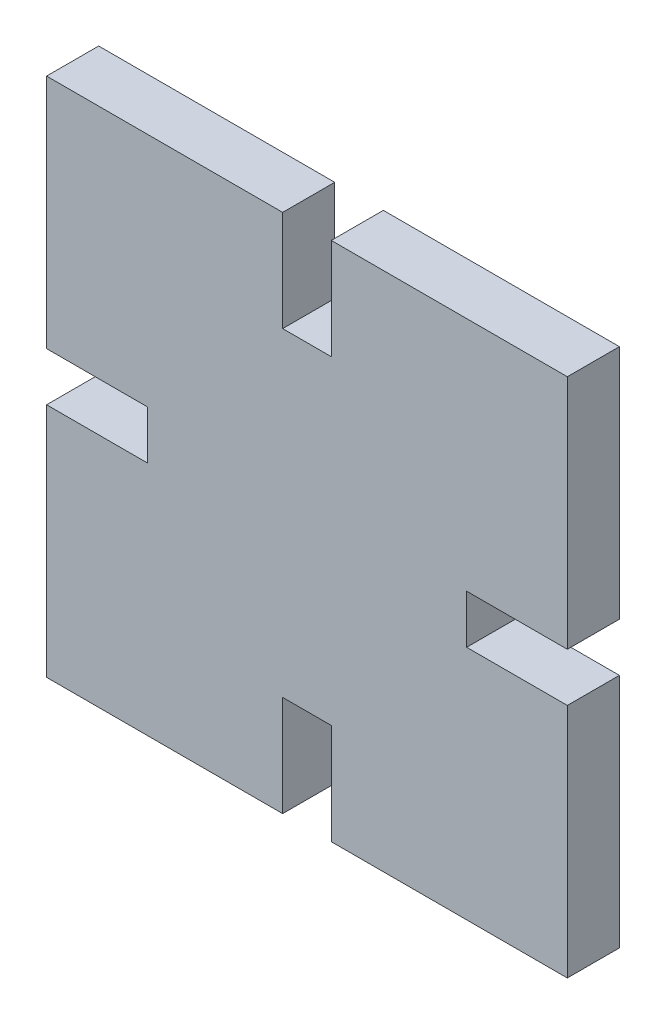
ISO-10303-21;
HEADER;
FILE_DESCRIPTION(('STEP AP214'),'2;1');
FILE_NAME('part.step','',(''),(''),'','','');
FILE_SCHEMA(('AUTOMOTIVE_DESIGN { 1 0 10303 214 1 1 1 1 }'));
ENDSEC;
DATA;
#1=APPLICATION_CONTEXT('core data for automotive mechanical design processes');
#2=APPLICATION_PROTOCOL_DEFINITION('international standard','automotive_design',2000,#1);
#3=PRODUCT_CONTEXT('',#1,'mechanical');
#4=PRODUCT('Part','Part','',(#3));
#5=PRODUCT_RELATED_PRODUCT_CATEGORY('part','',(#4));
#6=PRODUCT_DEFINITION_FORMATION('','',#4);
#7=PRODUCT_DEFINITION_CONTEXT('part definition',#1,'design');
#8=PRODUCT_DEFINITION('design','',#6,#7);
#9=PRODUCT_DEFINITION_SHAPE('','',#8);
#10=(LENGTH_UNIT() NAMED_UNIT(*) SI_UNIT(.MILLI.,.METRE.));
#11=(NAMED_UNIT(*) PLANE_ANGLE_UNIT() SI_UNIT($,.RADIAN.));
#12=(NAMED_UNIT(*) SI_UNIT($,.STERADIAN.) SOLID_ANGLE_UNIT());
#13=UNCERTAINTY_MEASURE_WITH_UNIT(LENGTH_MEASURE(1.E-05),#10,'distance_accuracy_value','');
#14=(GEOMETRIC_REPRESENTATION_CONTEXT(3) GLOBAL_UNCERTAINTY_ASSIGNED_CONTEXT((#13)) GLOBAL_UNIT_ASSIGNED_CONTEXT((#10,
#11,#12)) REPRESENTATION_CONTEXT('',''));
#15=CARTESIAN_POINT('',(0.,0.,0.));
#16=DIRECTION('',(0.,0.,1.));
#17=DIRECTION('',(1.,0.,0.));
#18=AXIS2_PLACEMENT_3D('',#15,#16,#17);
#19=CARTESIAN_POINT('',(15.,-15.,3.));
#20=DIRECTION('',(-1.,0.,0.));
#21=DIRECTION('',(0.,0.,1.));
#22=AXIS2_PLACEMENT_3D('',#19,#20,#21);
#23=PLANE('',#22);
#24=DIRECTION('',(0.,1.,0.));
#25=VECTOR('',#24,1.);
#26=CARTESIAN_POINT('',(15.,-15.,0.));
#27=LINE('',#26,#25);
#28=CARTESIAN_POINT('',(15.,-15.,0.));
#29=VERTEX_POINT('',#28);
#30=CARTESIAN_POINT('',(15.,-1.4,0.));
#31=VERTEX_POINT('',#30);
#32=EDGE_CURVE('E309',#29,#31,#27,.T.);
#33=ORIENTED_EDGE('',*,*,#32,.T.);
#34=DIRECTION('',(0.,0.,1.));
#35=VECTOR('',#34,1.);
#36=CARTESIAN_POINT('',(15.,-1.4,0.));
#37=LINE('',#36,#35);
#38=CARTESIAN_POINT('',(15.,-1.4,3.));
#39=VERTEX_POINT('',#38);
#40=EDGE_CURVE('E216',#31,#39,#37,.T.);
#41=ORIENTED_EDGE('',*,*,#40,.T.);
#42=DIRECTION('',(0.,1.,0.));
#43=VECTOR('',#42,1.);
#44=CARTESIAN_POINT('',(15.,-15.,3.));
#45=LINE('',#44,#43);
#46=CARTESIAN_POINT('',(15.,-15.,3.));
#47=VERTEX_POINT('',#46);
#48=EDGE_CURVE('E292',#47,#39,#45,.T.);
#49=ORIENTED_EDGE('',*,*,#48,.F.);
#50=DIRECTION('',(0.,0.,-1.));
#51=VECTOR('',#50,1.);
#52=CARTESIAN_POINT('',(15.,-15.,3.));
#53=LINE('',#52,#51);
#54=EDGE_CURVE('E308',#47,#29,#53,.T.);
#55=ORIENTED_EDGE('',*,*,#54,.T.);
#56=EDGE_LOOP('',(#33,#41,#49,#55));
#57=FACE_BOUND('',#56,.T.);
#58=ADVANCED_FACE('F33',(#57),#23,.F.);
#59=CARTESIAN_POINT('',(-15.,15.,3.));
#60=DIRECTION('',(0.,-1.,0.));
#61=DIRECTION('',(0.,0.,-1.));
#62=AXIS2_PLACEMENT_3D('',#59,#60,#61);
#63=PLANE('',#62);
#64=DIRECTION('',(-1.,0.,0.));
#65=VECTOR('',#64,1.);
#66=CARTESIAN_POINT('',(-15.,15.,3.));
#67=LINE('',#66,#65);
#68=CARTESIAN_POINT('',(-1.4,15.,3.));
#69=VERTEX_POINT('',#68);
#70=CARTESIAN_POINT('',(-15.,15.,3.));
#71=VERTEX_POINT('',#70);
#72=EDGE_CURVE('E295',#69,#71,#67,.T.);
#73=ORIENTED_EDGE('',*,*,#72,.F.);
#74=DIRECTION('',(0.,0.,1.));
#75=VECTOR('',#74,1.);
#76=CARTESIAN_POINT('',(-1.4,15.,0.));
#77=LINE('',#76,#75);
#78=CARTESIAN_POINT('',(-1.4,15.,0.));
#79=VERTEX_POINT('',#78);
#80=EDGE_CURVE('E206',#79,#69,#77,.T.);
#81=ORIENTED_EDGE('',*,*,#80,.F.);
#82=DIRECTION('',(-1.,0.,0.));
#83=VECTOR('',#82,1.);
#84=CARTESIAN_POINT('',(-15.,15.,0.));
#85=LINE('',#84,#83);
#86=CARTESIAN_POINT('',(-15.,15.,0.));
#87=VERTEX_POINT('',#86);
#88=EDGE_CURVE('E312',#79,#87,#85,.T.);
#89=ORIENTED_EDGE('',*,*,#88,.T.);
#90=DIRECTION('',(0.,0.,-1.));
#91=VECTOR('',#90,1.);
#92=CARTESIAN_POINT('',(-15.,15.,3.));
#93=LINE('',#92,#91);
#94=EDGE_CURVE('E41',#71,#87,#93,.T.);
#95=ORIENTED_EDGE('',*,*,#94,.F.);
#96=EDGE_LOOP('',(#73,#81,#89,#95));
#97=FACE_BOUND('',#96,.T.);
#98=ADVANCED_FACE('F342',(#97),#63,.F.);
#99=CARTESIAN_POINT('',(-15.,-15.,3.));
#100=DIRECTION('',(1.,0.,0.));
#101=DIRECTION('',(0.,0.,-1.));
#102=AXIS2_PLACEMENT_3D('',#99,#100,#101);
#103=PLANE('',#102);
#104=DIRECTION('',(0.,-1.,0.));
#105=VECTOR('',#104,1.);
#106=CARTESIAN_POINT('',(-15.,-15.,3.));
#107=LINE('',#106,#105);
#108=CARTESIAN_POINT('',(-15.,-1.4,3.));
#109=VERTEX_POINT('',#108);
#110=CARTESIAN_POINT('',(-15.,-15.,3.));
#111=VERTEX_POINT('',#110);
#112=EDGE_CURVE('E300',#109,#111,#107,.T.);
#113=ORIENTED_EDGE('',*,*,#112,.F.);
#114=DIRECTION('',(0.,0.,1.));
#115=VECTOR('',#114,1.);
#116=CARTESIAN_POINT('',(-15.,-1.4,0.));
#117=LINE('',#116,#115);
#118=CARTESIAN_POINT('',(-15.,-1.4,0.));
#119=VERTEX_POINT('',#118);
#120=EDGE_CURVE('E252',#119,#109,#117,.T.);
#121=ORIENTED_EDGE('',*,*,#120,.F.);
#122=DIRECTION('',(0.,-1.,0.));
#123=VECTOR('',#122,1.);
#124=CARTESIAN_POINT('',(-15.,-15.,0.));
#125=LINE('',#124,#123);
#126=CARTESIAN_POINT('',(-15.,-15.,0.));
#127=VERTEX_POINT('',#126);
#128=EDGE_CURVE('E315',#119,#127,#125,.T.);
#129=ORIENTED_EDGE('',*,*,#128,.T.);
#130=DIRECTION('',(0.,0.,-1.));
#131=VECTOR('',#130,1.);
#132=CARTESIAN_POINT('',(-15.,-15.,3.));
#133=LINE('',#132,#131);
#134=EDGE_CURVE('E325',#111,#127,#133,.T.);
#135=ORIENTED_EDGE('',*,*,#134,.F.);
#136=EDGE_LOOP('',(#113,#121,#129,#135));
#137=FACE_BOUND('',#136,.T.);
#138=ADVANCED_FACE('F383',(#137),#103,.F.);
#139=CARTESIAN_POINT('',(-15.,-15.,3.));
#140=DIRECTION('',(0.,1.,0.));
#141=DIRECTION('',(0.,0.,1.));
#142=AXIS2_PLACEMENT_3D('',#139,#140,#141);
#143=PLANE('',#142);
#144=DIRECTION('',(1.,0.,0.));
#145=VECTOR('',#144,1.);
#146=CARTESIAN_POINT('',(-15.,-15.,0.));
#147=LINE('',#146,#145);
#148=CARTESIAN_POINT('',(-1.4,-15.,0.));
#149=VERTEX_POINT('',#148);
#150=EDGE_CURVE('E320',#127,#149,#147,.T.);
#151=ORIENTED_EDGE('',*,*,#150,.T.);
#152=DIRECTION('',(0.,0.,1.));
#153=VECTOR('',#152,1.);
#154=CARTESIAN_POINT('',(-1.4,-15.,0.));
#155=LINE('',#154,#153);
#156=CARTESIAN_POINT('',(-1.4,-15.,3.));
#157=VERTEX_POINT('',#156);
#158=EDGE_CURVE('E231',#149,#157,#155,.T.);
#159=ORIENTED_EDGE('',*,*,#158,.T.);
#160=DIRECTION('',(1.,0.,0.));
#161=VECTOR('',#160,1.);
#162=CARTESIAN_POINT('',(-15.,-15.,3.));
#163=LINE('',#162,#161);
#164=EDGE_CURVE('E305',#111,#157,#163,.T.);
#165=ORIENTED_EDGE('',*,*,#164,.F.);
#166=ORIENTED_EDGE('',*,*,#134,.T.);
#167=EDGE_LOOP('',(#151,#159,#165,#166));
#168=FACE_BOUND('',#167,.T.);
#169=ADVANCED_FACE('F376',(#168),#143,.F.);
#170=CARTESIAN_POINT('',(15.,1.4,3.));
#171=VERTEX_POINT('',#170);
#172=CARTESIAN_POINT('',(15.,15.,3.));
#173=VERTEX_POINT('',#172);
#174=EDGE_CURVE('E296',#171,#173,#45,.T.);
#175=ORIENTED_EDGE('',*,*,#174,.F.);
#176=DIRECTION('',(0.,0.,1.));
#177=VECTOR('',#176,1.);
#178=CARTESIAN_POINT('',(15.,1.4,0.));
#179=LINE('',#178,#177);
#180=CARTESIAN_POINT('',(15.,1.4,0.));
#181=VERTEX_POINT('',#180);
#182=EDGE_CURVE('E219',#181,#171,#179,.T.);
#183=ORIENTED_EDGE('',*,*,#182,.F.);
#184=CARTESIAN_POINT('',(15.,15.,0.));
#185=VERTEX_POINT('',#184);
#186=EDGE_CURVE('E291',#181,#185,#27,.T.);
#187=ORIENTED_EDGE('',*,*,#186,.T.);
#188=DIRECTION('',(0.,0.,-1.));
#189=VECTOR('',#188,1.);
#190=CARTESIAN_POINT('',(15.,15.,3.));
#191=LINE('',#190,#189);
#192=EDGE_CURVE('E11',#173,#185,#191,.T.);
#193=ORIENTED_EDGE('',*,*,#192,.F.);
#194=EDGE_LOOP('',(#175,#183,#187,#193));
#195=FACE_BOUND('',#194,.T.);
#196=ADVANCED_FACE('F35',(#195),#23,.F.);
#197=CARTESIAN_POINT('',(1.4,15.,0.));
#198=VERTEX_POINT('',#197);
#199=EDGE_CURVE('E313',#185,#198,#85,.T.);
#200=ORIENTED_EDGE('',*,*,#199,.T.);
#201=DIRECTION('',(0.,0.,1.));
#202=VECTOR('',#201,1.);
#203=CARTESIAN_POINT('',(1.4,15.,0.));
#204=LINE('',#203,#202);
#205=CARTESIAN_POINT('',(1.4,15.,3.));
#206=VERTEX_POINT('',#205);
#207=EDGE_CURVE('E183',#198,#206,#204,.T.);
#208=ORIENTED_EDGE('',*,*,#207,.T.);
#209=EDGE_CURVE('E297',#173,#206,#67,.T.);
#210=ORIENTED_EDGE('',*,*,#209,.F.);
#211=ORIENTED_EDGE('',*,*,#192,.T.);
#212=EDGE_LOOP('',(#200,#208,#210,#211));
#213=FACE_BOUND('',#212,.T.);
#214=ADVANCED_FACE('F347',(#213),#63,.F.);
#215=CARTESIAN_POINT('',(-15.,1.4,0.));
#216=VERTEX_POINT('',#215);
#217=EDGE_CURVE('E316',#87,#216,#125,.T.);
#218=ORIENTED_EDGE('',*,*,#217,.T.);
#219=DIRECTION('',(0.,0.,1.));
#220=VECTOR('',#219,1.);
#221=CARTESIAN_POINT('',(-15.,1.4,0.));
#222=LINE('',#221,#220);
#223=CARTESIAN_POINT('',(-15.,1.4,3.));
#224=VERTEX_POINT('',#223);
#225=EDGE_CURVE('E254',#216,#224,#222,.T.);
#226=ORIENTED_EDGE('',*,*,#225,.T.);
#227=EDGE_CURVE('E301',#71,#224,#107,.T.);
#228=ORIENTED_EDGE('',*,*,#227,.F.);
#229=ORIENTED_EDGE('',*,*,#94,.T.);
#230=EDGE_LOOP('',(#218,#226,#228,#229));
#231=FACE_BOUND('',#230,.T.);
#232=ADVANCED_FACE('F332',(#231),#103,.F.);
#233=CARTESIAN_POINT('',(1.4,-15.,3.));
#234=VERTEX_POINT('',#233);
#235=EDGE_CURVE('E304',#234,#47,#163,.T.);
#236=ORIENTED_EDGE('',*,*,#235,.F.);
#237=DIRECTION('',(0.,0.,1.));
#238=VECTOR('',#237,1.);
#239=CARTESIAN_POINT('',(1.4,-15.,0.));
#240=LINE('',#239,#238);
#241=CARTESIAN_POINT('',(1.4,-15.,0.));
#242=VERTEX_POINT('',#241);
#243=EDGE_CURVE('E236',#242,#234,#240,.T.);
#244=ORIENTED_EDGE('',*,*,#243,.F.);
#245=EDGE_CURVE('E319',#242,#29,#147,.T.);
#246=ORIENTED_EDGE('',*,*,#245,.T.);
#247=ORIENTED_EDGE('',*,*,#54,.F.);
#248=EDGE_LOOP('',(#236,#244,#246,#247));
#249=FACE_BOUND('',#248,.T.);
#250=ADVANCED_FACE('F366',(#249),#143,.F.);
#251=CARTESIAN_POINT('',(0.,0.,3.));
#252=DIRECTION('',(0.,0.,-1.));
#253=DIRECTION('',(-1.,0.,0.));
#254=AXIS2_PLACEMENT_3D('',#251,#252,#253);
#255=PLANE('',#254);
#256=DIRECTION('',(-1.,0.,0.));
#257=VECTOR('',#256,1.);
#258=CARTESIAN_POINT('',(0.,9.2,3.));
#259=LINE('',#258,#257);
#260=CARTESIAN_POINT('',(1.4,9.2,3.));
#261=VERTEX_POINT('',#260);
#262=CARTESIAN_POINT('',(-1.4,9.2,3.));
#263=VERTEX_POINT('',#262);
#264=EDGE_CURVE('E180',#261,#263,#259,.T.);
#265=ORIENTED_EDGE('',*,*,#264,.T.);
#266=DIRECTION('',(0.,1.,0.));
#267=VECTOR('',#266,1.);
#268=CARTESIAN_POINT('',(-1.4,0.,3.));
#269=LINE('',#268,#267);
#270=EDGE_CURVE('E287',#263,#69,#269,.T.);
#271=ORIENTED_EDGE('',*,*,#270,.T.);
#272=ORIENTED_EDGE('',*,*,#72,.T.);
#273=ORIENTED_EDGE('',*,*,#227,.T.);
#274=DIRECTION('',(1.,0.,0.));
#275=VECTOR('',#274,1.);
#276=CARTESIAN_POINT('',(0.,1.4,3.));
#277=LINE('',#276,#275);
#278=CARTESIAN_POINT('',(-9.2,1.4,3.));
#279=VERTEX_POINT('',#278);
#280=EDGE_CURVE('E205',#224,#279,#277,.T.);
#281=ORIENTED_EDGE('',*,*,#280,.T.);
#282=DIRECTION('',(0.,-1.,0.));
#283=VECTOR('',#282,1.);
#284=CARTESIAN_POINT('',(-9.2,0.,3.));
#285=LINE('',#284,#283);
#286=CARTESIAN_POINT('',(-9.2,-1.4,3.));
#287=VERTEX_POINT('',#286);
#288=EDGE_CURVE('E264',#279,#287,#285,.T.);
#289=ORIENTED_EDGE('',*,*,#288,.T.);
#290=DIRECTION('',(-1.,0.,0.));
#291=VECTOR('',#290,1.);
#292=CARTESIAN_POINT('',(0.,-1.4,3.));
#293=LINE('',#292,#291);
#294=EDGE_CURVE('E261',#287,#109,#293,.T.);
#295=ORIENTED_EDGE('',*,*,#294,.T.);
#296=ORIENTED_EDGE('',*,*,#112,.T.);
#297=ORIENTED_EDGE('',*,*,#164,.T.);
#298=DIRECTION('',(0.,1.,0.));
#299=VECTOR('',#298,1.);
#300=CARTESIAN_POINT('',(-1.4,0.,3.));
#301=LINE('',#300,#299);
#302=CARTESIAN_POINT('',(-1.4,-9.2,3.));
#303=VERTEX_POINT('',#302);
#304=EDGE_CURVE('E273',#157,#303,#301,.T.);
#305=ORIENTED_EDGE('',*,*,#304,.T.);
#306=DIRECTION('',(1.,0.,0.));
#307=VECTOR('',#306,1.);
#308=CARTESIAN_POINT('',(0.,-9.2,3.));
#309=LINE('',#308,#307);
#310=CARTESIAN_POINT('',(1.4,-9.2,3.));
#311=VERTEX_POINT('',#310);
#312=EDGE_CURVE('E270',#303,#311,#309,.T.);
#313=ORIENTED_EDGE('',*,*,#312,.T.);
#314=DIRECTION('',(0.,-1.,0.));
#315=VECTOR('',#314,1.);
#316=CARTESIAN_POINT('',(1.4,0.,3.));
#317=LINE('',#316,#315);
#318=EDGE_CURVE('E267',#311,#234,#317,.T.);
#319=ORIENTED_EDGE('',*,*,#318,.T.);
#320=ORIENTED_EDGE('',*,*,#235,.T.);
#321=ORIENTED_EDGE('',*,*,#48,.T.);
#322=DIRECTION('',(-1.,0.,0.));
#323=VECTOR('',#322,1.);
#324=CARTESIAN_POINT('',(0.,-1.4,3.));
#325=LINE('',#324,#323);
#326=CARTESIAN_POINT('',(9.2,-1.4,3.));
#327=VERTEX_POINT('',#326);
#328=EDGE_CURVE('E282',#39,#327,#325,.T.);
#329=ORIENTED_EDGE('',*,*,#328,.T.);
#330=DIRECTION('',(0.,1.,0.));
#331=VECTOR('',#330,1.);
#332=CARTESIAN_POINT('',(9.2,0.,3.));
#333=LINE('',#332,#331);
#334=CARTESIAN_POINT('',(9.2,1.4,3.));
#335=VERTEX_POINT('',#334);
#336=EDGE_CURVE('E279',#327,#335,#333,.T.);
#337=ORIENTED_EDGE('',*,*,#336,.T.);
#338=DIRECTION('',(1.,0.,0.));
#339=VECTOR('',#338,1.);
#340=CARTESIAN_POINT('',(0.,1.4,3.));
#341=LINE('',#340,#339);
#342=EDGE_CURVE('E276',#335,#171,#341,.T.);
#343=ORIENTED_EDGE('',*,*,#342,.T.);
#344=ORIENTED_EDGE('',*,*,#174,.T.);
#345=ORIENTED_EDGE('',*,*,#209,.T.);
#346=DIRECTION('',(0.,-1.,0.));
#347=VECTOR('',#346,1.);
#348=CARTESIAN_POINT('',(1.4,0.,3.));
#349=LINE('',#348,#347);
#350=EDGE_CURVE('E285',#206,#261,#349,.T.);
#351=ORIENTED_EDGE('',*,*,#350,.T.);
#352=EDGE_LOOP('',(#265,#271,#272,#273,#281,#289,#295,#296,#297,#305,#313,#319,#320,#321,#329,
#337,#343,#344,#345,#351));
#353=FACE_BOUND('',#352,.T.);
#354=ADVANCED_FACE('F340',(#353),#255,.F.);
#355=CARTESIAN_POINT('',(0.,0.,0.));
#356=DIRECTION('',(0.,0.,-1.));
#357=DIRECTION('',(-1.,0.,0.));
#358=AXIS2_PLACEMENT_3D('',#355,#356,#357);
#359=PLANE('',#358);
#360=DIRECTION('',(0.,-1.,0.));
#361=VECTOR('',#360,1.);
#362=CARTESIAN_POINT('',(-1.4,9.2,0.));
#363=LINE('',#362,#361);
#364=CARTESIAN_POINT('',(-1.4,9.2,0.));
#365=VERTEX_POINT('',#364);
#366=EDGE_CURVE('E184',#79,#365,#363,.T.);
#367=ORIENTED_EDGE('',*,*,#366,.T.);
#368=DIRECTION('',(1.,0.,0.));
#369=VECTOR('',#368,1.);
#370=CARTESIAN_POINT('',(-1.4,9.2,0.));
#371=LINE('',#370,#369);
#372=CARTESIAN_POINT('',(1.4,9.2,0.));
#373=VERTEX_POINT('',#372);
#374=EDGE_CURVE('E177',#365,#373,#371,.T.);
#375=ORIENTED_EDGE('',*,*,#374,.T.);
#376=DIRECTION('',(0.,1.,0.));
#377=VECTOR('',#376,1.);
#378=CARTESIAN_POINT('',(1.4,9.2,0.));
#379=LINE('',#378,#377);
#380=EDGE_CURVE('E187',#373,#198,#379,.T.);
#381=ORIENTED_EDGE('',*,*,#380,.T.);
#382=ORIENTED_EDGE('',*,*,#199,.F.);
#383=ORIENTED_EDGE('',*,*,#186,.F.);
#384=DIRECTION('',(-1.,0.,0.));
#385=VECTOR('',#384,1.);
#386=CARTESIAN_POINT('',(9.2,1.4,0.));
#387=LINE('',#386,#385);
#388=CARTESIAN_POINT('',(9.2,1.4,0.));
#389=VERTEX_POINT('',#388);
#390=EDGE_CURVE('E212',#181,#389,#387,.T.);
#391=ORIENTED_EDGE('',*,*,#390,.T.);
#392=DIRECTION('',(0.,-1.,0.));
#393=VECTOR('',#392,1.);
#394=CARTESIAN_POINT('',(9.2,-1.4,0.));
#395=LINE('',#394,#393);
#396=CARTESIAN_POINT('',(9.2,-1.4,0.));
#397=VERTEX_POINT('',#396);
#398=EDGE_CURVE('E48',#389,#397,#395,.T.);
#399=ORIENTED_EDGE('',*,*,#398,.T.);
#400=DIRECTION('',(1.,0.,0.));
#401=VECTOR('',#400,1.);
#402=CARTESIAN_POINT('',(9.2,-1.4,0.));
#403=LINE('',#402,#401);
#404=EDGE_CURVE('E209',#397,#31,#403,.T.);
#405=ORIENTED_EDGE('',*,*,#404,.T.);
#406=ORIENTED_EDGE('',*,*,#32,.F.);
#407=ORIENTED_EDGE('',*,*,#245,.F.);
#408=DIRECTION('',(0.,1.,0.));
#409=VECTOR('',#408,1.);
#410=CARTESIAN_POINT('',(1.4,-9.2,0.));
#411=LINE('',#410,#409);
#412=CARTESIAN_POINT('',(1.4,-9.2,0.));
#413=VERTEX_POINT('',#412);
#414=EDGE_CURVE('E226',#242,#413,#411,.T.);
#415=ORIENTED_EDGE('',*,*,#414,.T.);
#416=DIRECTION('',(-1.,0.,0.));
#417=VECTOR('',#416,1.);
#418=CARTESIAN_POINT('',(-1.4,-9.2,0.));
#419=LINE('',#418,#417);
#420=CARTESIAN_POINT('',(-1.4,-9.2,0.));
#421=VERTEX_POINT('',#420);
#422=EDGE_CURVE('E56',#413,#421,#419,.T.);
#423=ORIENTED_EDGE('',*,*,#422,.T.);
#424=DIRECTION('',(0.,-1.,0.));
#425=VECTOR('',#424,1.);
#426=CARTESIAN_POINT('',(-1.4,-9.2,0.));
#427=LINE('',#426,#425);
#428=EDGE_CURVE('E223',#421,#149,#427,.T.);
#429=ORIENTED_EDGE('',*,*,#428,.T.);
#430=ORIENTED_EDGE('',*,*,#150,.F.);
#431=ORIENTED_EDGE('',*,*,#128,.F.);
#432=DIRECTION('',(1.,0.,0.));
#433=VECTOR('',#432,1.);
#434=CARTESIAN_POINT('',(-9.2,-1.4,0.));
#435=LINE('',#434,#433);
#436=CARTESIAN_POINT('',(-9.2,-1.4,0.));
#437=VERTEX_POINT('',#436);
#438=EDGE_CURVE('E246',#119,#437,#435,.T.);
#439=ORIENTED_EDGE('',*,*,#438,.T.);
#440=DIRECTION('',(0.,1.,0.));
#441=VECTOR('',#440,1.);
#442=CARTESIAN_POINT('',(-9.2,-1.4,0.));
#443=LINE('',#442,#441);
#444=CARTESIAN_POINT('',(-9.2,1.4,0.));
#445=VERTEX_POINT('',#444);
#446=EDGE_CURVE('E240',#437,#445,#443,.T.);
#447=ORIENTED_EDGE('',*,*,#446,.T.);
#448=DIRECTION('',(-1.,0.,0.));
#449=VECTOR('',#448,1.);
#450=CARTESIAN_POINT('',(-9.2,1.4,0.));
#451=LINE('',#450,#449);
#452=EDGE_CURVE('E243',#445,#216,#451,.T.);
#453=ORIENTED_EDGE('',*,*,#452,.T.);
#454=ORIENTED_EDGE('',*,*,#217,.F.);
#455=ORIENTED_EDGE('',*,*,#88,.F.);
#456=EDGE_LOOP('',(#367,#375,#381,#382,#383,#391,#399,#405,#406,#407,#415,#423,#429,#430,#431,
#439,#447,#453,#454,#455));
#457=FACE_BOUND('',#456,.T.);
#458=ADVANCED_FACE('F194',(#457),#359,.T.);
#459=CARTESIAN_POINT('',(-9.2,-1.4,0.));
#460=DIRECTION('',(1.,0.,0.));
#461=DIRECTION('',(0.,0.,-1.));
#462=AXIS2_PLACEMENT_3D('',#459,#460,#461);
#463=PLANE('',#462);
#464=DIRECTION('',(0.,0.,1.));
#465=VECTOR('',#464,1.);
#466=CARTESIAN_POINT('',(-9.2,1.4,0.));
#467=LINE('',#466,#465);
#468=EDGE_CURVE('E249',#445,#279,#467,.T.);
#469=ORIENTED_EDGE('',*,*,#468,.F.);
#470=ORIENTED_EDGE('',*,*,#446,.F.);
#471=DIRECTION('',(0.,0.,1.));
#472=VECTOR('',#471,1.);
#473=CARTESIAN_POINT('',(-9.2,-1.4,0.));
#474=LINE('',#473,#472);
#475=EDGE_CURVE('E227',#437,#287,#474,.T.);
#476=ORIENTED_EDGE('',*,*,#475,.T.);
#477=ORIENTED_EDGE('',*,*,#288,.F.);
#478=EDGE_LOOP('',(#469,#470,#476,#477));
#479=FACE_BOUND('',#478,.T.);
#480=ADVANCED_FACE('F387',(#479),#463,.F.);
#481=CARTESIAN_POINT('',(-9.2,-1.4,0.));
#482=DIRECTION('',(0.,-1.,0.));
#483=DIRECTION('',(1.,0.,0.));
#484=AXIS2_PLACEMENT_3D('',#481,#482,#483);
#485=PLANE('',#484);
#486=ORIENTED_EDGE('',*,*,#475,.F.);
#487=ORIENTED_EDGE('',*,*,#438,.F.);
#488=ORIENTED_EDGE('',*,*,#120,.T.);
#489=ORIENTED_EDGE('',*,*,#294,.F.);
#490=EDGE_LOOP('',(#486,#487,#488,#489));
#491=FACE_BOUND('',#490,.T.);
#492=ADVANCED_FACE('F385',(#491),#485,.F.);
#493=CARTESIAN_POINT('',(-9.2,1.4,0.));
#494=DIRECTION('',(0.,1.,0.));
#495=DIRECTION('',(-1.,0.,0.));
#496=AXIS2_PLACEMENT_3D('',#493,#494,#495);
#497=PLANE('',#496);
#498=ORIENTED_EDGE('',*,*,#225,.F.);
#499=ORIENTED_EDGE('',*,*,#452,.F.);
#500=ORIENTED_EDGE('',*,*,#468,.T.);
#501=ORIENTED_EDGE('',*,*,#280,.F.);
#502=EDGE_LOOP('',(#498,#499,#500,#501));
#503=FACE_BOUND('',#502,.T.);
#504=ADVANCED_FACE('F338',(#503),#497,.F.);
#505=CARTESIAN_POINT('',(-1.4,-9.2,0.));
#506=DIRECTION('',(-1.,0.,0.));
#507=DIRECTION('',(0.,-1.,0.));
#508=AXIS2_PLACEMENT_3D('',#505,#506,#507);
#509=PLANE('',#508);
#510=ORIENTED_EDGE('',*,*,#158,.F.);
#511=ORIENTED_EDGE('',*,*,#428,.F.);
#512=DIRECTION('',(0.,0.,1.));
#513=VECTOR('',#512,1.);
#514=CARTESIAN_POINT('',(-1.4,-9.2,0.));
#515=LINE('',#514,#513);
#516=EDGE_CURVE('E213',#421,#303,#515,.T.);
#517=ORIENTED_EDGE('',*,*,#516,.T.);
#518=ORIENTED_EDGE('',*,*,#304,.F.);
#519=EDGE_LOOP('',(#510,#511,#517,#518));
#520=FACE_BOUND('',#519,.T.);
#521=ADVANCED_FACE('F373',(#520),#509,.F.);
#522=CARTESIAN_POINT('',(-1.4,-9.2,0.));
#523=DIRECTION('',(0.,1.,0.));
#524=DIRECTION('',(0.,0.,1.));
#525=AXIS2_PLACEMENT_3D('',#522,#523,#524);
#526=PLANE('',#525);
#527=ORIENTED_EDGE('',*,*,#516,.F.);
#528=ORIENTED_EDGE('',*,*,#422,.F.);
#529=DIRECTION('',(0.,0.,1.));
#530=VECTOR('',#529,1.);
#531=CARTESIAN_POINT('',(1.4,-9.2,0.));
#532=LINE('',#531,#530);
#533=EDGE_CURVE('E234',#413,#311,#532,.T.);
#534=ORIENTED_EDGE('',*,*,#533,.T.);
#535=ORIENTED_EDGE('',*,*,#312,.F.);
#536=EDGE_LOOP('',(#527,#528,#534,#535));
#537=FACE_BOUND('',#536,.T.);
#538=ADVANCED_FACE('F370',(#537),#526,.F.);
#539=CARTESIAN_POINT('',(1.4,-9.2,0.));
#540=DIRECTION('',(1.,0.,0.));
#541=DIRECTION('',(0.,1.,0.));
#542=AXIS2_PLACEMENT_3D('',#539,#540,#541);
#543=PLANE('',#542);
#544=ORIENTED_EDGE('',*,*,#533,.F.);
#545=ORIENTED_EDGE('',*,*,#414,.F.);
#546=ORIENTED_EDGE('',*,*,#243,.T.);
#547=ORIENTED_EDGE('',*,*,#318,.F.);
#548=EDGE_LOOP('',(#544,#545,#546,#547));
#549=FACE_BOUND('',#548,.T.);
#550=ADVANCED_FACE('F369',(#549),#543,.F.);
#551=CARTESIAN_POINT('',(9.2,-1.4,0.));
#552=DIRECTION('',(0.,-1.,0.));
#553=DIRECTION('',(1.,0.,0.));
#554=AXIS2_PLACEMENT_3D('',#551,#552,#553);
#555=PLANE('',#554);
#556=ORIENTED_EDGE('',*,*,#40,.F.);
#557=ORIENTED_EDGE('',*,*,#404,.F.);
#558=DIRECTION('',(0.,0.,1.));
#559=VECTOR('',#558,1.);
#560=CARTESIAN_POINT('',(9.2,-1.4,0.));
#561=LINE('',#560,#559);
#562=EDGE_CURVE('E196',#397,#327,#561,.T.);
#563=ORIENTED_EDGE('',*,*,#562,.T.);
#564=ORIENTED_EDGE('',*,*,#328,.F.);
#565=EDGE_LOOP('',(#556,#557,#563,#564));
#566=FACE_BOUND('',#565,.T.);
#567=ADVANCED_FACE('F358',(#566),#555,.F.);
#568=CARTESIAN_POINT('',(9.2,-1.4,0.));
#569=DIRECTION('',(-1.,0.,0.));
#570=DIRECTION('',(0.,0.,1.));
#571=AXIS2_PLACEMENT_3D('',#568,#569,#570);
#572=PLANE('',#571);
#573=ORIENTED_EDGE('',*,*,#562,.F.);
#574=ORIENTED_EDGE('',*,*,#398,.F.);
#575=DIRECTION('',(0.,0.,1.));
#576=VECTOR('',#575,1.);
#577=CARTESIAN_POINT('',(9.2,1.4,0.));
#578=LINE('',#577,#576);
#579=EDGE_CURVE('E199',#389,#335,#578,.T.);
#580=ORIENTED_EDGE('',*,*,#579,.T.);
#581=ORIENTED_EDGE('',*,*,#336,.F.);
#582=EDGE_LOOP('',(#573,#574,#580,#581));
#583=FACE_BOUND('',#582,.T.);
#584=ADVANCED_FACE('F355',(#583),#572,.F.);
#585=CARTESIAN_POINT('',(9.2,1.4,0.));
#586=DIRECTION('',(0.,1.,0.));
#587=DIRECTION('',(-1.,0.,0.));
#588=AXIS2_PLACEMENT_3D('',#585,#586,#587);
#589=PLANE('',#588);
#590=ORIENTED_EDGE('',*,*,#579,.F.);
#591=ORIENTED_EDGE('',*,*,#390,.F.);
#592=ORIENTED_EDGE('',*,*,#182,.T.);
#593=ORIENTED_EDGE('',*,*,#342,.F.);
#594=EDGE_LOOP('',(#590,#591,#592,#593));
#595=FACE_BOUND('',#594,.T.);
#596=ADVANCED_FACE('F354',(#595),#589,.F.);
#597=CARTESIAN_POINT('',(-1.4,9.2,0.));
#598=DIRECTION('',(0.,-1.,0.));
#599=DIRECTION('',(0.,0.,-1.));
#600=AXIS2_PLACEMENT_3D('',#597,#598,#599);
#601=PLANE('',#600);
#602=DIRECTION('',(0.,0.,1.));
#603=VECTOR('',#602,1.);
#604=CARTESIAN_POINT('',(1.4,9.2,0.));
#605=LINE('',#604,#603);
#606=EDGE_CURVE('E172',#373,#261,#605,.T.);
#607=ORIENTED_EDGE('',*,*,#606,.F.);
#608=ORIENTED_EDGE('',*,*,#374,.F.);
#609=DIRECTION('',(0.,0.,1.));
#610=VECTOR('',#609,1.);
#611=CARTESIAN_POINT('',(-1.4,9.2,0.));
#612=LINE('',#611,#610);
#613=EDGE_CURVE('E203',#365,#263,#612,.T.);
#614=ORIENTED_EDGE('',*,*,#613,.T.);
#615=ORIENTED_EDGE('',*,*,#264,.F.);
#616=EDGE_LOOP('',(#607,#608,#614,#615));
#617=FACE_BOUND('',#616,.T.);
#618=ADVANCED_FACE('F174',(#617),#601,.F.);
#619=CARTESIAN_POINT('',(-1.4,9.2,0.));
#620=DIRECTION('',(-1.,0.,0.));
#621=DIRECTION('',(0.,-1.,0.));
#622=AXIS2_PLACEMENT_3D('',#619,#620,#621);
#623=PLANE('',#622);
#624=ORIENTED_EDGE('',*,*,#613,.F.);
#625=ORIENTED_EDGE('',*,*,#366,.F.);
#626=ORIENTED_EDGE('',*,*,#80,.T.);
#627=ORIENTED_EDGE('',*,*,#270,.F.);
#628=EDGE_LOOP('',(#624,#625,#626,#627));
#629=FACE_BOUND('',#628,.T.);
#630=ADVANCED_FACE('F344',(#629),#623,.F.);
#631=CARTESIAN_POINT('',(1.4,9.2,0.));
#632=DIRECTION('',(1.,0.,0.));
#633=DIRECTION('',(0.,1.,0.));
#634=AXIS2_PLACEMENT_3D('',#631,#632,#633);
#635=PLANE('',#634);
#636=ORIENTED_EDGE('',*,*,#207,.F.);
#637=ORIENTED_EDGE('',*,*,#380,.F.);
#638=ORIENTED_EDGE('',*,*,#606,.T.);
#639=ORIENTED_EDGE('',*,*,#350,.F.);
#640=EDGE_LOOP('',(#636,#637,#638,#639));
#641=FACE_BOUND('',#640,.T.);
#642=ADVANCED_FACE('F188',(#641),#635,.F.);
#643=CLOSED_SHELL('',(#58,#98,#138,#169,#196,#214,#232,#250,#354,#458,#480,#492,#504,#521,#538,
#550,#567,#584,#596,#618,#630,#642));
#644=MANIFOLD_SOLID_BREP('B2',#643);
#645=ADVANCED_BREP_SHAPE_REPRESENTATION('',(#18,#644),#14);
#646=SHAPE_DEFINITION_REPRESENTATION(#9,#645);
ENDSEC;
END-ISO-10303-21;
